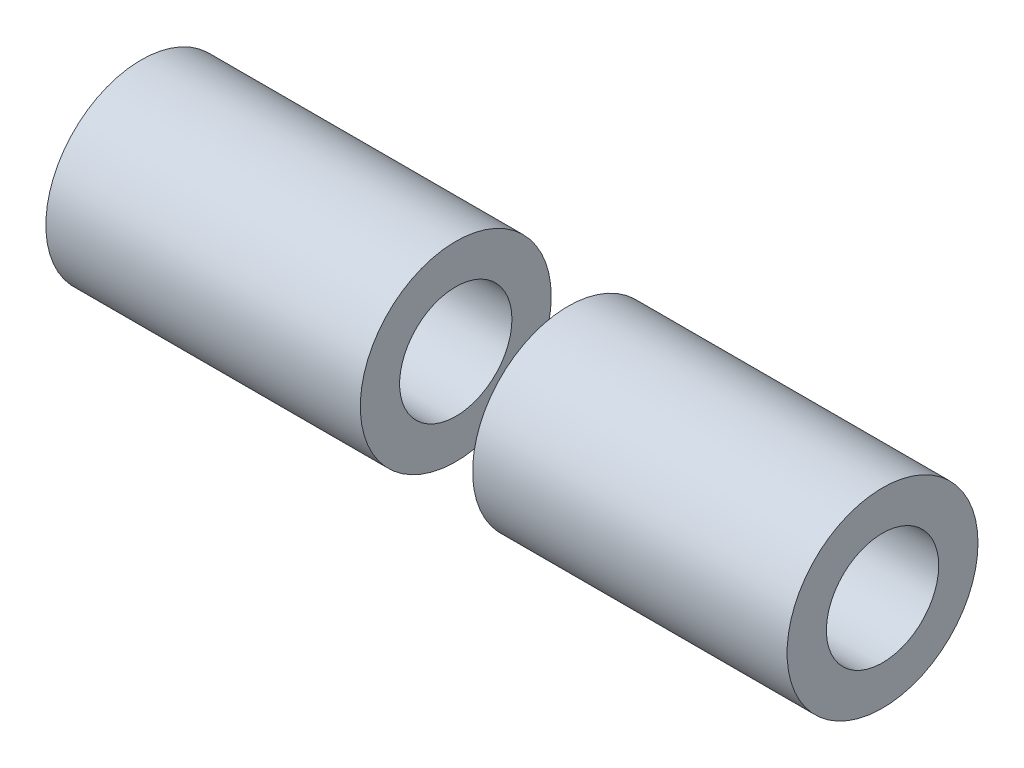
ISO-10303-21;
HEADER;
FILE_DESCRIPTION(('STEP AP214'),'2;1');
FILE_NAME('part.step','',(''),(''),'','','');
FILE_SCHEMA(('AUTOMOTIVE_DESIGN { 1 0 10303 214 1 1 1 1 }'));
ENDSEC;
DATA;
#1=APPLICATION_CONTEXT('core data for automotive mechanical design processes');
#2=APPLICATION_PROTOCOL_DEFINITION('international standard','automotive_design',2000,#1);
#3=PRODUCT_CONTEXT('',#1,'mechanical');
#4=PRODUCT('Part','Part','',(#3));
#5=PRODUCT_RELATED_PRODUCT_CATEGORY('part','',(#4));
#6=PRODUCT_DEFINITION_FORMATION('','',#4);
#7=PRODUCT_DEFINITION_CONTEXT('part definition',#1,'design');
#8=PRODUCT_DEFINITION('design','',#6,#7);
#9=PRODUCT_DEFINITION_SHAPE('','',#8);
#10=(LENGTH_UNIT() NAMED_UNIT(*) SI_UNIT(.MILLI.,.METRE.));
#11=(NAMED_UNIT(*) PLANE_ANGLE_UNIT() SI_UNIT($,.RADIAN.));
#12=(NAMED_UNIT(*) SI_UNIT($,.STERADIAN.) SOLID_ANGLE_UNIT());
#13=UNCERTAINTY_MEASURE_WITH_UNIT(LENGTH_MEASURE(1.E-05),#10,'distance_accuracy_value','');
#14=(GEOMETRIC_REPRESENTATION_CONTEXT(3) GLOBAL_UNCERTAINTY_ASSIGNED_CONTEXT((#13)) GLOBAL_UNIT_ASSIGNED_CONTEXT((#10,
#11,#12)) REPRESENTATION_CONTEXT('',''));
#15=CARTESIAN_POINT('',(0.,0.,0.));
#16=DIRECTION('',(0.,0.,1.));
#17=DIRECTION('',(1.,0.,0.));
#18=AXIS2_PLACEMENT_3D('',#15,#16,#17);
#19=CARTESIAN_POINT('',(-33.,0.,0.));
#20=DIRECTION('',(-1.,0.,0.));
#21=DIRECTION('',(0.,0.,-1.));
#22=AXIS2_PLACEMENT_3D('',#19,#20,#21);
#23=PLANE('',#22);
#24=CARTESIAN_POINT('',(-33.,0.,0.));
#25=DIRECTION('',(1.,0.,0.));
#26=DIRECTION('',(0.,0.,-1.));
#27=AXIS2_PLACEMENT_3D('',#24,#25,#26);
#28=CIRCLE('',#27,8.5);
#29=CARTESIAN_POINT('',(-33.,0.,-8.5));
#30=VERTEX_POINT('',#29);
#31=EDGE_CURVE('E11',#30,#30,#28,.T.);
#32=ORIENTED_EDGE('',*,*,#31,.F.);
#33=EDGE_LOOP('',(#32));
#34=FACE_BOUND('',#33,.T.);
#35=CARTESIAN_POINT('',(-33.,0.,0.));
#36=DIRECTION('',(1.,0.,0.));
#37=DIRECTION('',(0.,0.,-1.));
#38=AXIS2_PLACEMENT_3D('',#35,#36,#37);
#39=CIRCLE('',#38,5.);
#40=CARTESIAN_POINT('',(-33.,0.,-5.));
#41=VERTEX_POINT('',#40);
#42=EDGE_CURVE('E50',#41,#41,#39,.T.);
#43=ORIENTED_EDGE('',*,*,#42,.T.);
#44=EDGE_LOOP('',(#43));
#45=FACE_BOUND('',#44,.T.);
#46=ADVANCED_FACE('F39',(#34,#45),#23,.T.);
#47=CARTESIAN_POINT('',(-5.,0.,0.));
#48=DIRECTION('',(-1.,0.,0.));
#49=DIRECTION('',(0.,0.,-1.));
#50=AXIS2_PLACEMENT_3D('',#47,#48,#49);
#51=PLANE('',#50);
#52=CARTESIAN_POINT('',(-5.,0.,0.));
#53=DIRECTION('',(1.,0.,0.));
#54=DIRECTION('',(0.,0.,-1.));
#55=AXIS2_PLACEMENT_3D('',#52,#53,#54);
#56=CIRCLE('',#55,8.5);
#57=CARTESIAN_POINT('',(-5.,0.,-8.5));
#58=VERTEX_POINT('',#57);
#59=EDGE_CURVE('E43',#58,#58,#56,.T.);
#60=ORIENTED_EDGE('',*,*,#59,.T.);
#61=EDGE_LOOP('',(#60));
#62=FACE_BOUND('',#61,.T.);
#63=CARTESIAN_POINT('',(-5.,0.,0.));
#64=DIRECTION('',(1.,0.,0.));
#65=DIRECTION('',(0.,0.,-1.));
#66=AXIS2_PLACEMENT_3D('',#63,#64,#65);
#67=CIRCLE('',#66,5.);
#68=CARTESIAN_POINT('',(-5.,0.,-5.));
#69=VERTEX_POINT('',#68);
#70=EDGE_CURVE('E52',#69,#69,#67,.T.);
#71=ORIENTED_EDGE('',*,*,#70,.F.);
#72=EDGE_LOOP('',(#71));
#73=FACE_BOUND('',#72,.T.);
#74=ADVANCED_FACE('F65',(#62,#73),#51,.F.);
#75=CARTESIAN_POINT('',(-33.,0.,0.));
#76=DIRECTION('',(1.,0.,0.));
#77=DIRECTION('',(0.,0.,1.));
#78=AXIS2_PLACEMENT_3D('',#75,#76,#77);
#79=CYLINDRICAL_SURFACE('',#78,8.5);
#80=ORIENTED_EDGE('',*,*,#31,.T.);
#81=EDGE_LOOP('',(#80));
#82=FACE_BOUND('',#81,.T.);
#83=ORIENTED_EDGE('',*,*,#59,.F.);
#84=EDGE_LOOP('',(#83));
#85=FACE_BOUND('',#84,.T.);
#86=ADVANCED_FACE('F41',(#82,#85),#79,.T.);
#87=CARTESIAN_POINT('',(-33.,0.,0.));
#88=DIRECTION('',(1.,0.,0.));
#89=DIRECTION('',(0.,0.,1.));
#90=AXIS2_PLACEMENT_3D('',#87,#88,#89);
#91=CYLINDRICAL_SURFACE('',#90,5.);
#92=ORIENTED_EDGE('',*,*,#42,.F.);
#93=EDGE_LOOP('',(#92));
#94=FACE_BOUND('',#93,.T.);
#95=ORIENTED_EDGE('',*,*,#70,.T.);
#96=EDGE_LOOP('',(#95));
#97=FACE_BOUND('',#96,.T.);
#98=ADVANCED_FACE('F59',(#94,#97),#91,.F.);
#99=CLOSED_SHELL('',(#46,#74,#86,#98));
#100=MANIFOLD_SOLID_BREP('B2',#99);
#101=CARTESIAN_POINT('',(33.,0.,0.));
#102=DIRECTION('',(1.,0.,0.));
#103=DIRECTION('',(0.,0.,-1.));
#104=AXIS2_PLACEMENT_3D('',#101,#102,#103);
#105=PLANE('',#104);
#106=CARTESIAN_POINT('',(33.,0.,0.));
#107=DIRECTION('',(1.,0.,0.));
#108=DIRECTION('',(0.,0.,-1.));
#109=AXIS2_PLACEMENT_3D('',#106,#107,#108);
#110=CIRCLE('',#109,8.5);
#111=CARTESIAN_POINT('',(33.,0.,-8.5));
#112=VERTEX_POINT('',#111);
#113=EDGE_CURVE('E38',#112,#112,#110,.T.);
#114=ORIENTED_EDGE('',*,*,#113,.T.);
#115=EDGE_LOOP('',(#114));
#116=FACE_BOUND('',#115,.T.);
#117=CARTESIAN_POINT('',(33.,0.,0.));
#118=DIRECTION('',(1.,0.,0.));
#119=DIRECTION('',(0.,0.,-1.));
#120=AXIS2_PLACEMENT_3D('',#117,#118,#119);
#121=CIRCLE('',#120,5.);
#122=CARTESIAN_POINT('',(33.,0.,-5.));
#123=VERTEX_POINT('',#122);
#124=EDGE_CURVE('E112',#123,#123,#121,.T.);
#125=ORIENTED_EDGE('',*,*,#124,.F.);
#126=EDGE_LOOP('',(#125));
#127=FACE_BOUND('',#126,.T.);
#128=ADVANCED_FACE('F101',(#116,#127),#105,.T.);
#129=CARTESIAN_POINT('',(5.,0.,0.));
#130=DIRECTION('',(1.,0.,0.));
#131=DIRECTION('',(0.,0.,-1.));
#132=AXIS2_PLACEMENT_3D('',#129,#130,#131);
#133=PLANE('',#132);
#134=CARTESIAN_POINT('',(5.,0.,0.));
#135=DIRECTION('',(1.,0.,0.));
#136=DIRECTION('',(0.,0.,-1.));
#137=AXIS2_PLACEMENT_3D('',#134,#135,#136);
#138=CIRCLE('',#137,8.5);
#139=CARTESIAN_POINT('',(5.,0.,-8.5));
#140=VERTEX_POINT('',#139);
#141=EDGE_CURVE('E105',#140,#140,#138,.T.);
#142=ORIENTED_EDGE('',*,*,#141,.F.);
#143=EDGE_LOOP('',(#142));
#144=FACE_BOUND('',#143,.T.);
#145=CARTESIAN_POINT('',(5.,0.,0.));
#146=DIRECTION('',(1.,0.,0.));
#147=DIRECTION('',(0.,0.,-1.));
#148=AXIS2_PLACEMENT_3D('',#145,#146,#147);
#149=CIRCLE('',#148,5.);
#150=CARTESIAN_POINT('',(5.,0.,-5.));
#151=VERTEX_POINT('',#150);
#152=EDGE_CURVE('E114',#151,#151,#149,.T.);
#153=ORIENTED_EDGE('',*,*,#152,.T.);
#154=EDGE_LOOP('',(#153));
#155=FACE_BOUND('',#154,.T.);
#156=ADVANCED_FACE('F124',(#144,#155),#133,.F.);
#157=CARTESIAN_POINT('',(33.,0.,0.));
#158=DIRECTION('',(-1.,0.,0.));
#159=DIRECTION('',(0.,0.,1.));
#160=AXIS2_PLACEMENT_3D('',#157,#158,#159);
#161=CYLINDRICAL_SURFACE('',#160,8.5);
#162=ORIENTED_EDGE('',*,*,#113,.F.);
#163=EDGE_LOOP('',(#162));
#164=FACE_BOUND('',#163,.T.);
#165=ORIENTED_EDGE('',*,*,#141,.T.);
#166=EDGE_LOOP('',(#165));
#167=FACE_BOUND('',#166,.T.);
#168=ADVANCED_FACE('F103',(#164,#167),#161,.T.);
#169=CARTESIAN_POINT('',(33.,0.,0.));
#170=DIRECTION('',(-1.,0.,0.));
#171=DIRECTION('',(0.,0.,1.));
#172=AXIS2_PLACEMENT_3D('',#169,#170,#171);
#173=CYLINDRICAL_SURFACE('',#172,5.);
#174=ORIENTED_EDGE('',*,*,#124,.T.);
#175=EDGE_LOOP('',(#174));
#176=FACE_BOUND('',#175,.T.);
#177=ORIENTED_EDGE('',*,*,#152,.F.);
#178=EDGE_LOOP('',(#177));
#179=FACE_BOUND('',#178,.T.);
#180=ADVANCED_FACE('F120',(#176,#179),#173,.F.);
#181=CLOSED_SHELL('',(#128,#156,#168,#180));
#182=MANIFOLD_SOLID_BREP('B6',#181);
#183=ADVANCED_BREP_SHAPE_REPRESENTATION('',(#18,#100,#182),#14);
#184=SHAPE_DEFINITION_REPRESENTATION(#9,#183);
ENDSEC;
END-ISO-10303-21;
